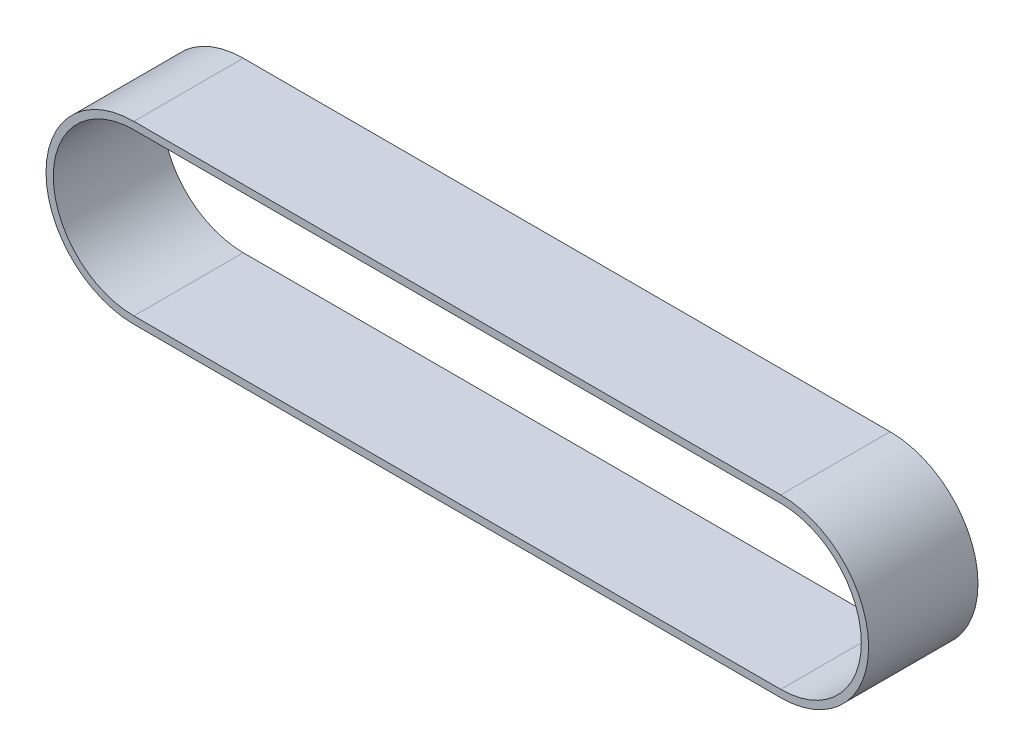
ISO-10303-21;
HEADER;
FILE_DESCRIPTION(('STEP AP214'),'2;1');
FILE_NAME('part.step','',(''),(''),'','','');
FILE_SCHEMA(('AUTOMOTIVE_DESIGN { 1 0 10303 214 1 1 1 1 }'));
ENDSEC;
DATA;
#1=APPLICATION_CONTEXT('core data for automotive mechanical design processes');
#2=APPLICATION_PROTOCOL_DEFINITION('international standard','automotive_design',2000,#1);
#3=PRODUCT_CONTEXT('',#1,'mechanical');
#4=PRODUCT('Part','Part','',(#3));
#5=PRODUCT_RELATED_PRODUCT_CATEGORY('part','',(#4));
#6=PRODUCT_DEFINITION_FORMATION('','',#4);
#7=PRODUCT_DEFINITION_CONTEXT('part definition',#1,'design');
#8=PRODUCT_DEFINITION('design','',#6,#7);
#9=PRODUCT_DEFINITION_SHAPE('','',#8);
#10=(LENGTH_UNIT() NAMED_UNIT(*) SI_UNIT(.MILLI.,.METRE.));
#11=(NAMED_UNIT(*) PLANE_ANGLE_UNIT() SI_UNIT($,.RADIAN.));
#12=(NAMED_UNIT(*) SI_UNIT($,.STERADIAN.) SOLID_ANGLE_UNIT());
#13=UNCERTAINTY_MEASURE_WITH_UNIT(LENGTH_MEASURE(1.E-05),#10,'distance_accuracy_value','');
#14=(GEOMETRIC_REPRESENTATION_CONTEXT(3) GLOBAL_UNCERTAINTY_ASSIGNED_CONTEXT((#13)) GLOBAL_UNIT_ASSIGNED_CONTEXT((#10,
#11,#12)) REPRESENTATION_CONTEXT('',''));
#15=CARTESIAN_POINT('',(0.,0.,0.));
#16=DIRECTION('',(0.,0.,1.));
#17=DIRECTION('',(1.,0.,0.));
#18=AXIS2_PLACEMENT_3D('',#15,#16,#17);
#19=CARTESIAN_POINT('',(-44.35,0.,15.));
#20=DIRECTION('',(0.,0.,1.));
#21=DIRECTION('',(1.,0.,0.));
#22=AXIS2_PLACEMENT_3D('',#19,#20,#21);
#23=PLANE('',#22);
#24=CARTESIAN_POINT('',(-44.35,0.,15.));
#25=DIRECTION('',(0.,0.,1.));
#26=DIRECTION('',(1.,0.,0.));
#27=AXIS2_PLACEMENT_3D('',#24,#25,#26);
#28=CIRCLE('',#27,12.05);
#29=CARTESIAN_POINT('',(-44.35,12.05,15.));
#30=VERTEX_POINT('',#29);
#31=CARTESIAN_POINT('',(-44.35,-12.05,15.));
#32=VERTEX_POINT('',#31);
#33=EDGE_CURVE('E136',#30,#32,#28,.T.);
#34=ORIENTED_EDGE('',*,*,#33,.T.);
#35=DIRECTION('',(1.,0.,0.));
#36=VECTOR('',#35,1.);
#37=CARTESIAN_POINT('',(-44.35,-12.05,15.));
#38=LINE('',#37,#36);
#39=CARTESIAN_POINT('',(44.35,-12.05,15.));
#40=VERTEX_POINT('',#39);
#41=EDGE_CURVE('E139',#32,#40,#38,.T.);
#42=ORIENTED_EDGE('',*,*,#41,.T.);
#43=CARTESIAN_POINT('',(44.35,0.,15.));
#44=DIRECTION('',(0.,0.,1.));
#45=DIRECTION('',(-1.,0.,0.));
#46=AXIS2_PLACEMENT_3D('',#43,#44,#45);
#47=CIRCLE('',#46,12.05);
#48=CARTESIAN_POINT('',(44.35,12.05,15.));
#49=VERTEX_POINT('',#48);
#50=EDGE_CURVE('E142',#40,#49,#47,.T.);
#51=ORIENTED_EDGE('',*,*,#50,.T.);
#52=DIRECTION('',(-1.,0.,0.));
#53=VECTOR('',#52,1.);
#54=CARTESIAN_POINT('',(-44.35,12.05,15.));
#55=LINE('',#54,#53);
#56=EDGE_CURVE('E144',#49,#30,#55,.T.);
#57=ORIENTED_EDGE('',*,*,#56,.T.);
#58=EDGE_LOOP('',(#34,#42,#51,#57));
#59=FACE_BOUND('',#58,.T.);
#60=DIRECTION('',(1.,0.,0.));
#61=VECTOR('',#60,1.);
#62=CARTESIAN_POINT('',(44.35,-11.05,15.));
#63=LINE('',#62,#61);
#64=CARTESIAN_POINT('',(-44.35,-11.05,15.));
#65=VERTEX_POINT('',#64);
#66=CARTESIAN_POINT('',(44.35,-11.05,15.));
#67=VERTEX_POINT('',#66);
#68=EDGE_CURVE('E108',#65,#67,#63,.T.);
#69=ORIENTED_EDGE('',*,*,#68,.F.);
#70=CARTESIAN_POINT('',(-44.35,0.,15.));
#71=DIRECTION('',(0.,0.,1.));
#72=DIRECTION('',(1.,0.,0.));
#73=AXIS2_PLACEMENT_3D('',#70,#71,#72);
#74=CIRCLE('',#73,11.05);
#75=CARTESIAN_POINT('',(-44.35,11.05,15.));
#76=VERTEX_POINT('',#75);
#77=EDGE_CURVE('E100',#76,#65,#74,.T.);
#78=ORIENTED_EDGE('',*,*,#77,.F.);
#79=DIRECTION('',(-1.,0.,0.));
#80=VECTOR('',#79,1.);
#81=CARTESIAN_POINT('',(-44.35,11.05,15.));
#82=LINE('',#81,#80);
#83=CARTESIAN_POINT('',(44.35,11.05,15.));
#84=VERTEX_POINT('',#83);
#85=EDGE_CURVE('E122',#84,#76,#82,.T.);
#86=ORIENTED_EDGE('',*,*,#85,.F.);
#87=CARTESIAN_POINT('',(44.35,0.,15.));
#88=DIRECTION('',(0.,0.,1.));
#89=DIRECTION('',(-1.,0.,0.));
#90=AXIS2_PLACEMENT_3D('',#87,#88,#89);
#91=CIRCLE('',#90,11.05);
#92=EDGE_CURVE('E120',#67,#84,#91,.T.);
#93=ORIENTED_EDGE('',*,*,#92,.F.);
#94=EDGE_LOOP('',(#69,#78,#86,#93));
#95=FACE_BOUND('',#94,.T.);
#96=ADVANCED_FACE('F35',(#59,#95),#23,.T.);
#97=CARTESIAN_POINT('',(-44.35,0.,0.));
#98=DIRECTION('',(0.,0.,1.));
#99=DIRECTION('',(1.,0.,0.));
#100=AXIS2_PLACEMENT_3D('',#97,#98,#99);
#101=PLANE('',#100);
#102=CARTESIAN_POINT('',(-44.35,0.,0.));
#103=DIRECTION('',(0.,0.,1.));
#104=DIRECTION('',(1.,0.,0.));
#105=AXIS2_PLACEMENT_3D('',#102,#103,#104);
#106=CIRCLE('',#105,12.05);
#107=CARTESIAN_POINT('',(-44.35,12.05,0.));
#108=VERTEX_POINT('',#107);
#109=CARTESIAN_POINT('',(-44.35,-12.05,0.));
#110=VERTEX_POINT('',#109);
#111=EDGE_CURVE('E116',#108,#110,#106,.T.);
#112=ORIENTED_EDGE('',*,*,#111,.F.);
#113=DIRECTION('',(-1.,0.,0.));
#114=VECTOR('',#113,1.);
#115=CARTESIAN_POINT('',(-44.35,12.05,0.));
#116=LINE('',#115,#114);
#117=CARTESIAN_POINT('',(44.35,12.05,0.));
#118=VERTEX_POINT('',#117);
#119=EDGE_CURVE('E140',#118,#108,#116,.T.);
#120=ORIENTED_EDGE('',*,*,#119,.F.);
#121=CARTESIAN_POINT('',(44.35,0.,0.));
#122=DIRECTION('',(0.,0.,1.));
#123=DIRECTION('',(-1.,0.,0.));
#124=AXIS2_PLACEMENT_3D('',#121,#122,#123);
#125=CIRCLE('',#124,12.05);
#126=CARTESIAN_POINT('',(44.35,-12.05,0.));
#127=VERTEX_POINT('',#126);
#128=EDGE_CURVE('E151',#127,#118,#125,.T.);
#129=ORIENTED_EDGE('',*,*,#128,.F.);
#130=DIRECTION('',(1.,0.,0.));
#131=VECTOR('',#130,1.);
#132=CARTESIAN_POINT('',(-44.35,-12.05,0.));
#133=LINE('',#132,#131);
#134=EDGE_CURVE('E149',#110,#127,#133,.T.);
#135=ORIENTED_EDGE('',*,*,#134,.F.);
#136=EDGE_LOOP('',(#112,#120,#129,#135));
#137=FACE_BOUND('',#136,.T.);
#138=CARTESIAN_POINT('',(-44.35,0.,0.));
#139=DIRECTION('',(0.,0.,1.));
#140=DIRECTION('',(1.,0.,0.));
#141=AXIS2_PLACEMENT_3D('',#138,#139,#140);
#142=CIRCLE('',#141,11.05);
#143=CARTESIAN_POINT('',(-44.35,11.05,0.));
#144=VERTEX_POINT('',#143);
#145=CARTESIAN_POINT('',(-44.35,-11.05,0.));
#146=VERTEX_POINT('',#145);
#147=EDGE_CURVE('E58',#144,#146,#142,.T.);
#148=ORIENTED_EDGE('',*,*,#147,.T.);
#149=DIRECTION('',(1.,0.,0.));
#150=VECTOR('',#149,1.);
#151=CARTESIAN_POINT('',(44.35,-11.05,0.));
#152=LINE('',#151,#150);
#153=CARTESIAN_POINT('',(44.35,-11.05,0.));
#154=VERTEX_POINT('',#153);
#155=EDGE_CURVE('E115',#146,#154,#152,.T.);
#156=ORIENTED_EDGE('',*,*,#155,.T.);
#157=CARTESIAN_POINT('',(44.35,0.,0.));
#158=DIRECTION('',(0.,0.,1.));
#159=DIRECTION('',(-1.,0.,0.));
#160=AXIS2_PLACEMENT_3D('',#157,#158,#159);
#161=CIRCLE('',#160,11.05);
#162=CARTESIAN_POINT('',(44.35,11.05,0.));
#163=VERTEX_POINT('',#162);
#164=EDGE_CURVE('E128',#154,#163,#161,.T.);
#165=ORIENTED_EDGE('',*,*,#164,.T.);
#166=DIRECTION('',(-1.,0.,0.));
#167=VECTOR('',#166,1.);
#168=CARTESIAN_POINT('',(-44.35,11.05,0.));
#169=LINE('',#168,#167);
#170=EDGE_CURVE('E109',#163,#144,#169,.T.);
#171=ORIENTED_EDGE('',*,*,#170,.T.);
#172=EDGE_LOOP('',(#148,#156,#165,#171));
#173=FACE_BOUND('',#172,.T.);
#174=ADVANCED_FACE('F169',(#137,#173),#101,.F.);
#175=CARTESIAN_POINT('',(-44.35,0.,15.));
#176=DIRECTION('',(0.,0.,-1.));
#177=DIRECTION('',(-1.,0.,0.));
#178=AXIS2_PLACEMENT_3D('',#175,#176,#177);
#179=CYLINDRICAL_SURFACE('',#178,12.05);
#180=ORIENTED_EDGE('',*,*,#111,.T.);
#181=DIRECTION('',(0.,0.,-1.));
#182=VECTOR('',#181,1.);
#183=CARTESIAN_POINT('',(-44.35,-12.05,15.));
#184=LINE('',#183,#182);
#185=EDGE_CURVE('E11',#32,#110,#184,.T.);
#186=ORIENTED_EDGE('',*,*,#185,.F.);
#187=ORIENTED_EDGE('',*,*,#33,.F.);
#188=DIRECTION('',(0.,0.,-1.));
#189=VECTOR('',#188,1.);
#190=CARTESIAN_POINT('',(-44.35,12.05,15.));
#191=LINE('',#190,#189);
#192=EDGE_CURVE('E146',#30,#108,#191,.T.);
#193=ORIENTED_EDGE('',*,*,#192,.T.);
#194=EDGE_LOOP('',(#180,#186,#187,#193));
#195=FACE_BOUND('',#194,.T.);
#196=ADVANCED_FACE('F37',(#195),#179,.T.);
#197=CARTESIAN_POINT('',(-44.35,-12.05,15.));
#198=DIRECTION('',(0.,1.,0.));
#199=DIRECTION('',(-1.,0.,0.));
#200=AXIS2_PLACEMENT_3D('',#197,#198,#199);
#201=PLANE('',#200);
#202=ORIENTED_EDGE('',*,*,#134,.T.);
#203=DIRECTION('',(0.,0.,-1.));
#204=VECTOR('',#203,1.);
#205=CARTESIAN_POINT('',(44.35,-12.05,15.));
#206=LINE('',#205,#204);
#207=EDGE_CURVE('E43',#40,#127,#206,.T.);
#208=ORIENTED_EDGE('',*,*,#207,.F.);
#209=ORIENTED_EDGE('',*,*,#41,.F.);
#210=ORIENTED_EDGE('',*,*,#185,.T.);
#211=EDGE_LOOP('',(#202,#208,#209,#210));
#212=FACE_BOUND('',#211,.T.);
#213=ADVANCED_FACE('F179',(#212),#201,.F.);
#214=CARTESIAN_POINT('',(44.35,0.,15.));
#215=DIRECTION('',(0.,0.,-1.));
#216=DIRECTION('',(-1.,0.,0.));
#217=AXIS2_PLACEMENT_3D('',#214,#215,#216);
#218=CYLINDRICAL_SURFACE('',#217,12.05);
#219=ORIENTED_EDGE('',*,*,#128,.T.);
#220=DIRECTION('',(0.,0.,-1.));
#221=VECTOR('',#220,1.);
#222=CARTESIAN_POINT('',(44.35,12.05,15.));
#223=LINE('',#222,#221);
#224=EDGE_CURVE('E156',#49,#118,#223,.T.);
#225=ORIENTED_EDGE('',*,*,#224,.F.);
#226=ORIENTED_EDGE('',*,*,#50,.F.);
#227=ORIENTED_EDGE('',*,*,#207,.T.);
#228=EDGE_LOOP('',(#219,#225,#226,#227));
#229=FACE_BOUND('',#228,.T.);
#230=ADVANCED_FACE('F163',(#229),#218,.T.);
#231=CARTESIAN_POINT('',(-44.35,12.05,15.));
#232=DIRECTION('',(0.,-1.,0.));
#233=DIRECTION('',(1.,0.,0.));
#234=AXIS2_PLACEMENT_3D('',#231,#232,#233);
#235=PLANE('',#234);
#236=ORIENTED_EDGE('',*,*,#119,.T.);
#237=ORIENTED_EDGE('',*,*,#192,.F.);
#238=ORIENTED_EDGE('',*,*,#56,.F.);
#239=ORIENTED_EDGE('',*,*,#224,.T.);
#240=EDGE_LOOP('',(#236,#237,#238,#239));
#241=FACE_BOUND('',#240,.T.);
#242=ADVANCED_FACE('F173',(#241),#235,.F.);
#243=CARTESIAN_POINT('',(-44.35,0.,15.));
#244=DIRECTION('',(0.,0.,-1.));
#245=DIRECTION('',(-1.,0.,0.));
#246=AXIS2_PLACEMENT_3D('',#243,#244,#245);
#247=CYLINDRICAL_SURFACE('',#246,11.05);
#248=ORIENTED_EDGE('',*,*,#147,.F.);
#249=DIRECTION('',(0.,0.,-1.));
#250=VECTOR('',#249,1.);
#251=CARTESIAN_POINT('',(-44.35,11.05,15.));
#252=LINE('',#251,#250);
#253=EDGE_CURVE('E104',#76,#144,#252,.T.);
#254=ORIENTED_EDGE('',*,*,#253,.F.);
#255=ORIENTED_EDGE('',*,*,#77,.T.);
#256=DIRECTION('',(0.,0.,-1.));
#257=VECTOR('',#256,1.);
#258=CARTESIAN_POINT('',(-44.35,-11.05,15.));
#259=LINE('',#258,#257);
#260=EDGE_CURVE('E103',#65,#146,#259,.T.);
#261=ORIENTED_EDGE('',*,*,#260,.T.);
#262=EDGE_LOOP('',(#248,#254,#255,#261));
#263=FACE_BOUND('',#262,.T.);
#264=ADVANCED_FACE('F102',(#263),#247,.F.);
#265=CARTESIAN_POINT('',(44.35,-11.05,15.));
#266=DIRECTION('',(0.,1.,0.));
#267=DIRECTION('',(-1.,0.,0.));
#268=AXIS2_PLACEMENT_3D('',#265,#266,#267);
#269=PLANE('',#268);
#270=ORIENTED_EDGE('',*,*,#155,.F.);
#271=ORIENTED_EDGE('',*,*,#260,.F.);
#272=ORIENTED_EDGE('',*,*,#68,.T.);
#273=DIRECTION('',(0.,0.,-1.));
#274=VECTOR('',#273,1.);
#275=CARTESIAN_POINT('',(44.35,-11.05,15.));
#276=LINE('',#275,#274);
#277=EDGE_CURVE('E117',#67,#154,#276,.T.);
#278=ORIENTED_EDGE('',*,*,#277,.T.);
#279=EDGE_LOOP('',(#270,#271,#272,#278));
#280=FACE_BOUND('',#279,.T.);
#281=ADVANCED_FACE('F112',(#280),#269,.T.);
#282=CARTESIAN_POINT('',(44.35,0.,15.));
#283=DIRECTION('',(0.,0.,-1.));
#284=DIRECTION('',(-1.,0.,0.));
#285=AXIS2_PLACEMENT_3D('',#282,#283,#284);
#286=CYLINDRICAL_SURFACE('',#285,11.05);
#287=ORIENTED_EDGE('',*,*,#164,.F.);
#288=ORIENTED_EDGE('',*,*,#277,.F.);
#289=ORIENTED_EDGE('',*,*,#92,.T.);
#290=DIRECTION('',(0.,0.,-1.));
#291=VECTOR('',#290,1.);
#292=CARTESIAN_POINT('',(44.35,11.05,15.));
#293=LINE('',#292,#291);
#294=EDGE_CURVE('E50',#84,#163,#293,.T.);
#295=ORIENTED_EDGE('',*,*,#294,.T.);
#296=EDGE_LOOP('',(#287,#288,#289,#295));
#297=FACE_BOUND('',#296,.T.);
#298=ADVANCED_FACE('F202',(#297),#286,.F.);
#299=CARTESIAN_POINT('',(-44.35,11.05,15.));
#300=DIRECTION('',(0.,-1.,0.));
#301=DIRECTION('',(1.,0.,0.));
#302=AXIS2_PLACEMENT_3D('',#299,#300,#301);
#303=PLANE('',#302);
#304=ORIENTED_EDGE('',*,*,#170,.F.);
#305=ORIENTED_EDGE('',*,*,#294,.F.);
#306=ORIENTED_EDGE('',*,*,#85,.T.);
#307=ORIENTED_EDGE('',*,*,#253,.T.);
#308=EDGE_LOOP('',(#304,#305,#306,#307));
#309=FACE_BOUND('',#308,.T.);
#310=ADVANCED_FACE('F206',(#309),#303,.T.);
#311=CLOSED_SHELL('',(#96,#174,#196,#213,#230,#242,#264,#281,#298,#310));
#312=MANIFOLD_SOLID_BREP('B2',#311);
#313=ADVANCED_BREP_SHAPE_REPRESENTATION('',(#18,#312),#14);
#314=SHAPE_DEFINITION_REPRESENTATION(#9,#313);
ENDSEC;
END-ISO-10303-21;
